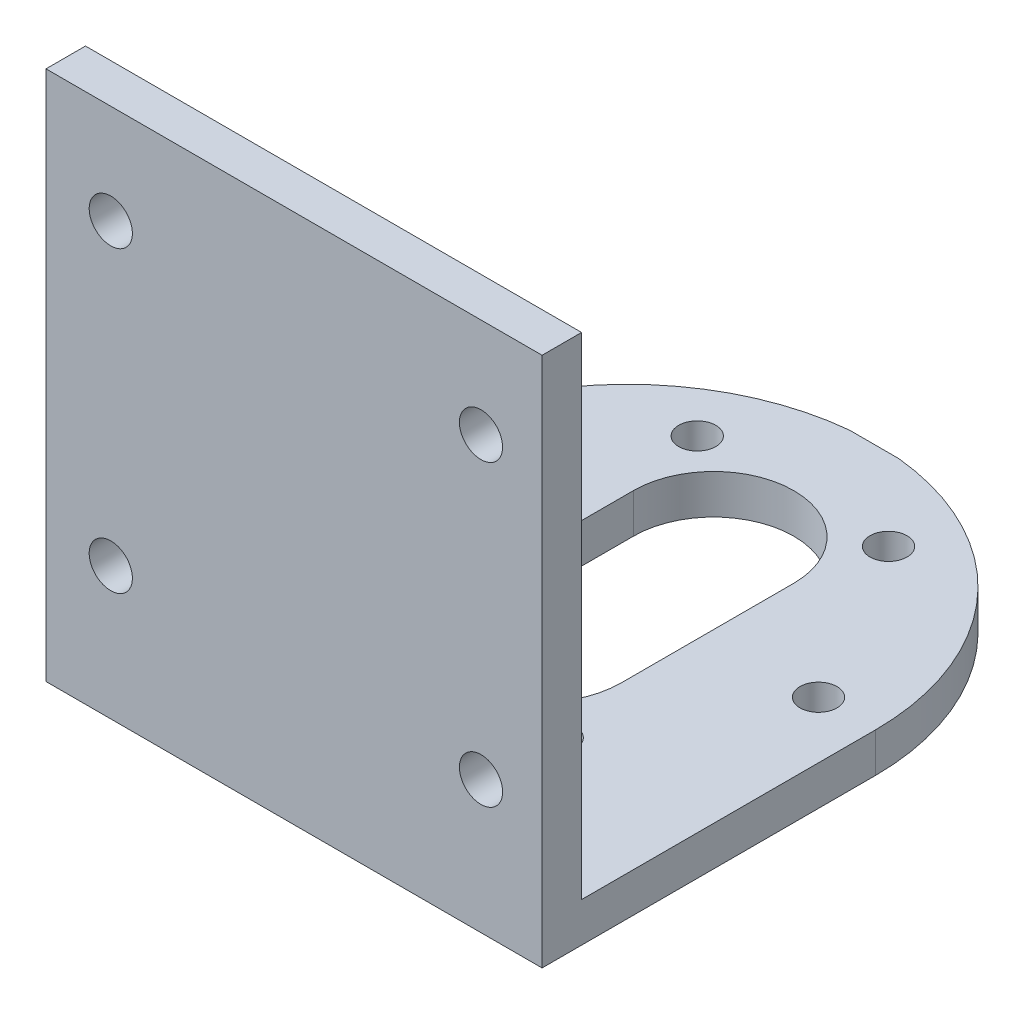
ISO-10303-21;
HEADER;
FILE_DESCRIPTION(('STEP AP214'),'2;1');
FILE_NAME('part.step','',(''),(''),'','','');
FILE_SCHEMA(('AUTOMOTIVE_DESIGN { 1 0 10303 214 1 1 1 1 }'));
ENDSEC;
DATA;
#1=APPLICATION_CONTEXT('core data for automotive mechanical design processes');
#2=APPLICATION_PROTOCOL_DEFINITION('international standard','automotive_design',2000,#1);
#3=PRODUCT_CONTEXT('',#1,'mechanical');
#4=PRODUCT('Part','Part','',(#3));
#5=PRODUCT_RELATED_PRODUCT_CATEGORY('part','',(#4));
#6=PRODUCT_DEFINITION_FORMATION('','',#4);
#7=PRODUCT_DEFINITION_CONTEXT('part definition',#1,'design');
#8=PRODUCT_DEFINITION('design','',#6,#7);
#9=PRODUCT_DEFINITION_SHAPE('','',#8);
#10=(LENGTH_UNIT() NAMED_UNIT(*) SI_UNIT(.MILLI.,.METRE.));
#11=(NAMED_UNIT(*) PLANE_ANGLE_UNIT() SI_UNIT($,.RADIAN.));
#12=(NAMED_UNIT(*) SI_UNIT($,.STERADIAN.) SOLID_ANGLE_UNIT());
#13=UNCERTAINTY_MEASURE_WITH_UNIT(LENGTH_MEASURE(1.E-05),#10,'distance_accuracy_value','');
#14=(GEOMETRIC_REPRESENTATION_CONTEXT(3) GLOBAL_UNCERTAINTY_ASSIGNED_CONTEXT((#13)) GLOBAL_UNIT_ASSIGNED_CONTEXT((#10,
#11,#12)) REPRESENTATION_CONTEXT('',''));
#15=CARTESIAN_POINT('',(0.,0.,0.));
#16=DIRECTION('',(0.,0.,1.));
#17=DIRECTION('',(1.,0.,0.));
#18=AXIS2_PLACEMENT_3D('',#15,#16,#17);
#19=CARTESIAN_POINT('',(0.,0.,3.2));
#20=DIRECTION('',(0.,1.,0.));
#21=DIRECTION('',(0.,0.,1.));
#22=AXIS2_PLACEMENT_3D('',#19,#20,#21);
#23=PLANE('',#22);
#24=CARTESIAN_POINT('',(4.6,0.,-23.8));
#25=DIRECTION('',(0.,-1.,0.));
#26=DIRECTION('',(0.,0.,-1.));
#27=AXIS2_PLACEMENT_3D('',#24,#25,#26);
#28=CIRCLE('',#27,3.02854263248526);
#29=CARTESIAN_POINT('',(4.6,0.,-26.8285426324853));
#30=VERTEX_POINT('',#29);
#31=EDGE_CURVE('E398',#30,#30,#28,.T.);
#32=ORIENTED_EDGE('',*,*,#31,.F.);
#33=EDGE_LOOP('',(#32));
#34=FACE_BOUND('',#33,.T.);
#35=CARTESIAN_POINT('',(27.8500000000001,0.,-10.3766062413412));
#36=DIRECTION('',(0.,-1.,0.));
#37=DIRECTION('',(0.,0.,-1.));
#38=AXIS2_PLACEMENT_3D('',#35,#36,#37);
#39=CIRCLE('',#38,3.02854263248526);
#40=CARTESIAN_POINT('',(27.8500000000001,0.,-13.4051488738265));
#41=VERTEX_POINT('',#40);
#42=EDGE_CURVE('E388',#41,#41,#39,.T.);
#43=ORIENTED_EDGE('',*,*,#42,.F.);
#44=EDGE_LOOP('',(#43));
#45=FACE_BOUND('',#44,.T.);
#46=CARTESIAN_POINT('',(35.6,0.,-23.8000000000001));
#47=DIRECTION('',(0.,-1.,0.));
#48=DIRECTION('',(0.,0.,-1.));
#49=AXIS2_PLACEMENT_3D('',#46,#47,#48);
#50=CIRCLE('',#49,3.02854263248526);
#51=CARTESIAN_POINT('',(35.6,0.,-26.8285426324854));
#52=VERTEX_POINT('',#51);
#53=EDGE_CURVE('E418',#52,#52,#50,.T.);
#54=ORIENTED_EDGE('',*,*,#53,.F.);
#55=EDGE_LOOP('',(#54));
#56=FACE_BOUND('',#55,.T.);
#57=CARTESIAN_POINT('',(12.3499999999998,0.,-37.2233937586587));
#58=DIRECTION('',(0.,-1.,0.));
#59=DIRECTION('',(0.,0.,-1.));
#60=AXIS2_PLACEMENT_3D('',#57,#58,#59);
#61=CIRCLE('',#60,3.02854263248526);
#62=CARTESIAN_POINT('',(12.3499999999998,0.,-40.251936391144));
#63=VERTEX_POINT('',#62);
#64=EDGE_CURVE('E408',#63,#63,#61,.T.);
#65=ORIENTED_EDGE('',*,*,#64,.F.);
#66=EDGE_LOOP('',(#65));
#67=FACE_BOUND('',#66,.T.);
#68=CARTESIAN_POINT('',(12.35,0.,-10.3766062413412));
#69=DIRECTION('',(0.,-1.,0.));
#70=DIRECTION('',(0.,0.,-1.));
#71=AXIS2_PLACEMENT_3D('',#68,#69,#70);
#72=CIRCLE('',#71,3.02854263248526);
#73=CARTESIAN_POINT('',(12.35,0.,-13.4051488738264));
#74=VERTEX_POINT('',#73);
#75=EDGE_CURVE('E380',#74,#74,#72,.T.);
#76=ORIENTED_EDGE('',*,*,#75,.F.);
#77=EDGE_LOOP('',(#76));
#78=FACE_BOUND('',#77,.T.);
#79=CARTESIAN_POINT('',(27.8499999999999,0.,-37.2233937586589));
#80=DIRECTION('',(0.,-1.,0.));
#81=DIRECTION('',(0.,0.,-1.));
#82=AXIS2_PLACEMENT_3D('',#79,#80,#81);
#83=CIRCLE('',#82,3.02854263248526);
#84=CARTESIAN_POINT('',(27.8499999999999,0.,-40.2519363911441));
#85=VERTEX_POINT('',#84);
#86=EDGE_CURVE('E412',#85,#85,#83,.T.);
#87=ORIENTED_EDGE('',*,*,#86,.F.);
#88=EDGE_LOOP('',(#87));
#89=FACE_BOUND('',#88,.T.);
#90=DIRECTION('',(0.,0.,1.));
#91=VECTOR('',#90,1.);
#92=CARTESIAN_POINT('',(13.6,0.,0.));
#93=LINE('',#92,#91);
#94=CARTESIAN_POINT('',(13.6,0.,-30.8));
#95=VERTEX_POINT('',#94);
#96=CARTESIAN_POINT('',(13.6,0.,-16.8));
#97=VERTEX_POINT('',#96);
#98=EDGE_CURVE('E269',#95,#97,#93,.T.);
#99=ORIENTED_EDGE('',*,*,#98,.T.);
#100=CARTESIAN_POINT('',(20.1,0.,-16.8));
#101=DIRECTION('',(0.,-1.,0.));
#102=DIRECTION('',(0.,0.,-1.));
#103=AXIS2_PLACEMENT_3D('',#100,#101,#102);
#104=CIRCLE('',#103,6.5);
#105=CARTESIAN_POINT('',(26.6,0.,-16.8));
#106=VERTEX_POINT('',#105);
#107=EDGE_CURVE('E453',#106,#97,#104,.T.);
#108=ORIENTED_EDGE('',*,*,#107,.F.);
#109=DIRECTION('',(0.,0.,-1.));
#110=VECTOR('',#109,1.);
#111=CARTESIAN_POINT('',(26.6,0.,0.));
#112=LINE('',#111,#110);
#113=CARTESIAN_POINT('',(26.6,0.,-30.8));
#114=VERTEX_POINT('',#113);
#115=EDGE_CURVE('E449',#106,#114,#112,.T.);
#116=ORIENTED_EDGE('',*,*,#115,.T.);
#117=CARTESIAN_POINT('',(20.1,0.,-30.8));
#118=DIRECTION('',(0.,-1.,0.));
#119=DIRECTION('',(0.,0.,-1.));
#120=AXIS2_PLACEMENT_3D('',#117,#118,#119);
#121=CIRCLE('',#120,6.5);
#122=EDGE_CURVE('E445',#95,#114,#121,.T.);
#123=ORIENTED_EDGE('',*,*,#122,.F.);
#124=EDGE_LOOP('',(#99,#108,#116,#123));
#125=FACE_BOUND('',#124,.T.);
#126=CARTESIAN_POINT('',(20.1,0.,-23.8));
#127=DIRECTION('',(0.,-1.,0.));
#128=DIRECTION('',(0.,0.,-1.));
#129=AXIS2_PLACEMENT_3D('',#126,#127,#128);
#130=CIRCLE('',#129,20.1);
#131=CARTESIAN_POINT('',(0.,0.,-23.8));
#132=VERTEX_POINT('',#131);
#133=CARTESIAN_POINT('',(18.0975015605499,0.,-43.8));
#134=VERTEX_POINT('',#133);
#135=EDGE_CURVE('E185',#132,#134,#130,.T.);
#136=ORIENTED_EDGE('',*,*,#135,.T.);
#137=DIRECTION('',(-1.,0.,0.));
#138=VECTOR('',#137,1.);
#139=CARTESIAN_POINT('',(40.2,0.,-43.8));
#140=LINE('',#139,#138);
#141=CARTESIAN_POINT('',(22.1024984394501,0.,-43.8));
#142=VERTEX_POINT('',#141);
#143=EDGE_CURVE('E287',#142,#134,#140,.T.);
#144=ORIENTED_EDGE('',*,*,#143,.F.);
#145=CARTESIAN_POINT('',(20.1,0.,-23.8));
#146=DIRECTION('',(0.,-1.,0.));
#147=DIRECTION('',(0.,0.,-1.));
#148=AXIS2_PLACEMENT_3D('',#145,#146,#147);
#149=CIRCLE('',#148,20.1);
#150=CARTESIAN_POINT('',(40.2,0.,-23.8));
#151=VERTEX_POINT('',#150);
#152=EDGE_CURVE('E121',#142,#151,#149,.T.);
#153=ORIENTED_EDGE('',*,*,#152,.T.);
#154=DIRECTION('',(0.,0.,-1.));
#155=VECTOR('',#154,1.);
#156=CARTESIAN_POINT('',(40.2,0.,3.2));
#157=LINE('',#156,#155);
#158=CARTESIAN_POINT('',(40.2,0.,3.2));
#159=VERTEX_POINT('',#158);
#160=EDGE_CURVE('E213',#159,#151,#157,.T.);
#161=ORIENTED_EDGE('',*,*,#160,.F.);
#162=DIRECTION('',(1.,0.,0.));
#163=VECTOR('',#162,1.);
#164=CARTESIAN_POINT('',(0.,0.,3.2));
#165=LINE('',#164,#163);
#166=CARTESIAN_POINT('',(0.,0.,3.2));
#167=VERTEX_POINT('',#166);
#168=EDGE_CURVE('E209',#167,#159,#165,.T.);
#169=ORIENTED_EDGE('',*,*,#168,.F.);
#170=DIRECTION('',(0.,0.,-1.));
#171=VECTOR('',#170,1.);
#172=CARTESIAN_POINT('',(0.,0.,3.2));
#173=LINE('',#172,#171);
#174=EDGE_CURVE('E200',#167,#132,#173,.T.);
#175=ORIENTED_EDGE('',*,*,#174,.T.);
#176=EDGE_LOOP('',(#136,#144,#153,#161,#169,#175));
#177=FACE_BOUND('',#176,.T.);
#178=ADVANCED_FACE('F98',(#34,#45,#56,#67,#78,#89,#125,#177),#23,.F.);
#179=CARTESIAN_POINT('',(40.2,3.2,-43.8));
#180=DIRECTION('',(0.,-1.,0.));
#181=DIRECTION('',(0.,0.,-1.));
#182=AXIS2_PLACEMENT_3D('',#179,#180,#181);
#183=PLANE('',#182);
#184=CARTESIAN_POINT('',(27.8499999999999,3.2,-37.2233937586589));
#185=DIRECTION('',(0.,-1.,0.));
#186=DIRECTION('',(0.,0.,-1.));
#187=AXIS2_PLACEMENT_3D('',#184,#185,#186);
#188=CIRCLE('',#187,1.5);
#189=CARTESIAN_POINT('',(27.8499999999999,3.2,-38.7233937586589));
#190=VERTEX_POINT('',#189);
#191=EDGE_CURVE('E256',#190,#190,#188,.T.);
#192=ORIENTED_EDGE('',*,*,#191,.T.);
#193=EDGE_LOOP('',(#192));
#194=FACE_BOUND('',#193,.T.);
#195=CARTESIAN_POINT('',(35.6,3.2,-23.8000000000001));
#196=DIRECTION('',(0.,-1.,0.));
#197=DIRECTION('',(0.,0.,-1.));
#198=AXIS2_PLACEMENT_3D('',#195,#196,#197);
#199=CIRCLE('',#198,1.5);
#200=CARTESIAN_POINT('',(35.6,3.2,-25.3000000000001));
#201=VERTEX_POINT('',#200);
#202=EDGE_CURVE('E252',#201,#201,#199,.T.);
#203=ORIENTED_EDGE('',*,*,#202,.T.);
#204=EDGE_LOOP('',(#203));
#205=FACE_BOUND('',#204,.T.);
#206=CARTESIAN_POINT('',(12.35,3.2,-10.3766062413412));
#207=DIRECTION('',(0.,-1.,0.));
#208=DIRECTION('',(0.,0.,-1.));
#209=AXIS2_PLACEMENT_3D('',#206,#207,#208);
#210=CIRCLE('',#209,1.5);
#211=CARTESIAN_POINT('',(12.35,3.2,-11.8766062413412));
#212=VERTEX_POINT('',#211);
#213=EDGE_CURVE('E248',#212,#212,#210,.T.);
#214=ORIENTED_EDGE('',*,*,#213,.T.);
#215=EDGE_LOOP('',(#214));
#216=FACE_BOUND('',#215,.T.);
#217=CARTESIAN_POINT('',(12.3499999999998,3.2,-37.2233937586587));
#218=DIRECTION('',(0.,-1.,0.));
#219=DIRECTION('',(0.,0.,-1.));
#220=AXIS2_PLACEMENT_3D('',#217,#218,#219);
#221=CIRCLE('',#220,1.5);
#222=CARTESIAN_POINT('',(12.3499999999998,3.2,-38.7233937586587));
#223=VERTEX_POINT('',#222);
#224=EDGE_CURVE('E244',#223,#223,#221,.T.);
#225=ORIENTED_EDGE('',*,*,#224,.T.);
#226=EDGE_LOOP('',(#225));
#227=FACE_BOUND('',#226,.T.);
#228=CARTESIAN_POINT('',(4.6,3.2,-23.8));
#229=DIRECTION('',(0.,-1.,0.));
#230=DIRECTION('',(0.,0.,-1.));
#231=AXIS2_PLACEMENT_3D('',#228,#229,#230);
#232=CIRCLE('',#231,1.5);
#233=CARTESIAN_POINT('',(4.6,3.2,-25.3));
#234=VERTEX_POINT('',#233);
#235=EDGE_CURVE('E239',#234,#234,#232,.T.);
#236=ORIENTED_EDGE('',*,*,#235,.T.);
#237=EDGE_LOOP('',(#236));
#238=FACE_BOUND('',#237,.T.);
#239=CARTESIAN_POINT('',(27.8500000000001,3.2,-10.3766062413412));
#240=DIRECTION('',(0.,-1.,0.));
#241=DIRECTION('',(0.,0.,-1.));
#242=AXIS2_PLACEMENT_3D('',#239,#240,#241);
#243=CIRCLE('',#242,1.5);
#244=CARTESIAN_POINT('',(27.8500000000001,3.2,-11.8766062413412));
#245=VERTEX_POINT('',#244);
#246=EDGE_CURVE('E235',#245,#245,#243,.T.);
#247=ORIENTED_EDGE('',*,*,#246,.T.);
#248=EDGE_LOOP('',(#247));
#249=FACE_BOUND('',#248,.T.);
#250=DIRECTION('',(0.,0.,1.));
#251=VECTOR('',#250,1.);
#252=CARTESIAN_POINT('',(13.6,3.2,-43.8));
#253=LINE('',#252,#251);
#254=CARTESIAN_POINT('',(13.6,3.2,-30.8));
#255=VERTEX_POINT('',#254);
#256=CARTESIAN_POINT('',(13.6,3.2,-16.8));
#257=VERTEX_POINT('',#256);
#258=EDGE_CURVE('E232',#255,#257,#253,.T.);
#259=ORIENTED_EDGE('',*,*,#258,.F.);
#260=CARTESIAN_POINT('',(20.1,3.2,-30.8));
#261=DIRECTION('',(0.,-1.,0.));
#262=DIRECTION('',(0.,0.,-1.));
#263=AXIS2_PLACEMENT_3D('',#260,#261,#262);
#264=CIRCLE('',#263,6.5);
#265=CARTESIAN_POINT('',(26.6,3.2,-30.8));
#266=VERTEX_POINT('',#265);
#267=EDGE_CURVE('E212',#255,#266,#264,.T.);
#268=ORIENTED_EDGE('',*,*,#267,.T.);
#269=DIRECTION('',(0.,0.,-1.));
#270=VECTOR('',#269,1.);
#271=CARTESIAN_POINT('',(26.6,3.2,-43.8));
#272=LINE('',#271,#270);
#273=CARTESIAN_POINT('',(26.6,3.2,-16.8));
#274=VERTEX_POINT('',#273);
#275=EDGE_CURVE('E218',#274,#266,#272,.T.);
#276=ORIENTED_EDGE('',*,*,#275,.F.);
#277=CARTESIAN_POINT('',(20.1,3.2,-16.8));
#278=DIRECTION('',(0.,-1.,0.));
#279=DIRECTION('',(0.,0.,-1.));
#280=AXIS2_PLACEMENT_3D('',#277,#278,#279);
#281=CIRCLE('',#280,6.5);
#282=EDGE_CURVE('E228',#274,#257,#281,.T.);
#283=ORIENTED_EDGE('',*,*,#282,.T.);
#284=EDGE_LOOP('',(#259,#268,#276,#283));
#285=FACE_BOUND('',#284,.T.);
#286=CARTESIAN_POINT('',(20.1,3.2,-23.8));
#287=DIRECTION('',(0.,-1.,0.));
#288=DIRECTION('',(0.,0.,-1.));
#289=AXIS2_PLACEMENT_3D('',#286,#287,#288);
#290=CIRCLE('',#289,20.1);
#291=CARTESIAN_POINT('',(0.,3.2,-23.8));
#292=VERTEX_POINT('',#291);
#293=CARTESIAN_POINT('',(18.0975015605499,3.2,-43.8));
#294=VERTEX_POINT('',#293);
#295=EDGE_CURVE('E113',#292,#294,#290,.T.);
#296=ORIENTED_EDGE('',*,*,#295,.F.);
#297=DIRECTION('',(0.,0.,1.));
#298=VECTOR('',#297,1.);
#299=CARTESIAN_POINT('',(0.,3.2,-43.8));
#300=LINE('',#299,#298);
#301=CARTESIAN_POINT('',(0.,3.2,0.));
#302=VERTEX_POINT('',#301);
#303=EDGE_CURVE('E203',#292,#302,#300,.T.);
#304=ORIENTED_EDGE('',*,*,#303,.T.);
#305=DIRECTION('',(1.,0.,0.));
#306=VECTOR('',#305,1.);
#307=CARTESIAN_POINT('',(40.2,3.2,0.));
#308=LINE('',#307,#306);
#309=CARTESIAN_POINT('',(40.2,3.2,0.));
#310=VERTEX_POINT('',#309);
#311=EDGE_CURVE('E260',#302,#310,#308,.T.);
#312=ORIENTED_EDGE('',*,*,#311,.T.);
#313=DIRECTION('',(0.,0.,1.));
#314=VECTOR('',#313,1.);
#315=CARTESIAN_POINT('',(40.2,3.2,-43.8));
#316=LINE('',#315,#314);
#317=CARTESIAN_POINT('',(40.2,3.2,-23.8));
#318=VERTEX_POINT('',#317);
#319=EDGE_CURVE('E282',#318,#310,#316,.T.);
#320=ORIENTED_EDGE('',*,*,#319,.F.);
#321=CARTESIAN_POINT('',(20.1,3.2,-23.8));
#322=DIRECTION('',(0.,-1.,0.));
#323=DIRECTION('',(0.,0.,-1.));
#324=AXIS2_PLACEMENT_3D('',#321,#322,#323);
#325=CIRCLE('',#324,20.1);
#326=CARTESIAN_POINT('',(22.1024984394501,3.2,-43.8));
#327=VERTEX_POINT('',#326);
#328=EDGE_CURVE('E205',#327,#318,#325,.T.);
#329=ORIENTED_EDGE('',*,*,#328,.F.);
#330=DIRECTION('',(1.,0.,0.));
#331=VECTOR('',#330,1.);
#332=CARTESIAN_POINT('',(40.2,3.2,-43.8));
#333=LINE('',#332,#331);
#334=EDGE_CURVE('E280',#294,#327,#333,.T.);
#335=ORIENTED_EDGE('',*,*,#334,.F.);
#336=EDGE_LOOP('',(#296,#304,#312,#320,#329,#335));
#337=FACE_BOUND('',#336,.T.);
#338=ADVANCED_FACE('F279',(#194,#205,#216,#227,#238,#249,#285,#337),#183,.F.);
#339=CARTESIAN_POINT('',(0.,0.,3.2));
#340=DIRECTION('',(-1.,0.,0.));
#341=DIRECTION('',(0.,0.,1.));
#342=AXIS2_PLACEMENT_3D('',#339,#340,#341);
#343=PLANE('',#342);
#344=ORIENTED_EDGE('',*,*,#303,.F.);
#345=DIRECTION('',(0.,-1.,0.));
#346=VECTOR('',#345,1.);
#347=CARTESIAN_POINT('',(0.,43.,-23.8));
#348=LINE('',#347,#346);
#349=EDGE_CURVE('E188',#292,#132,#348,.T.);
#350=ORIENTED_EDGE('',*,*,#349,.T.);
#351=ORIENTED_EDGE('',*,*,#174,.F.);
#352=DIRECTION('',(0.,1.,0.));
#353=VECTOR('',#352,1.);
#354=CARTESIAN_POINT('',(0.,0.,3.2));
#355=LINE('',#354,#353);
#356=CARTESIAN_POINT('',(0.,43.,3.2));
#357=VERTEX_POINT('',#356);
#358=EDGE_CURVE('E313',#167,#357,#355,.T.);
#359=ORIENTED_EDGE('',*,*,#358,.T.);
#360=DIRECTION('',(0.,0.,-1.));
#361=VECTOR('',#360,1.);
#362=CARTESIAN_POINT('',(0.,43.,3.2));
#363=LINE('',#362,#361);
#364=CARTESIAN_POINT('',(0.,43.,0.));
#365=VERTEX_POINT('',#364);
#366=EDGE_CURVE('E329',#357,#365,#363,.T.);
#367=ORIENTED_EDGE('',*,*,#366,.T.);
#368=DIRECTION('',(0.,1.,0.));
#369=VECTOR('',#368,1.);
#370=CARTESIAN_POINT('',(0.,0.,0.));
#371=LINE('',#370,#369);
#372=EDGE_CURVE('E341',#302,#365,#371,.T.);
#373=ORIENTED_EDGE('',*,*,#372,.F.);
#374=EDGE_LOOP('',(#344,#350,#351,#359,#367,#373));
#375=FACE_BOUND('',#374,.T.);
#376=ADVANCED_FACE('F198',(#375),#343,.T.);
#377=CARTESIAN_POINT('',(40.2,0.,3.2));
#378=DIRECTION('',(-1.,0.,0.));
#379=DIRECTION('',(0.,0.,1.));
#380=AXIS2_PLACEMENT_3D('',#377,#378,#379);
#381=PLANE('',#380);
#382=DIRECTION('',(0.,-1.,0.));
#383=VECTOR('',#382,1.);
#384=CARTESIAN_POINT('',(40.2,43.,-23.8));
#385=LINE('',#384,#383);
#386=EDGE_CURVE('E194',#318,#151,#385,.T.);
#387=ORIENTED_EDGE('',*,*,#386,.F.);
#388=ORIENTED_EDGE('',*,*,#319,.T.);
#389=DIRECTION('',(0.,1.,0.));
#390=VECTOR('',#389,1.);
#391=CARTESIAN_POINT('',(40.2,0.,0.));
#392=LINE('',#391,#390);
#393=CARTESIAN_POINT('',(40.2,43.,0.));
#394=VERTEX_POINT('',#393);
#395=EDGE_CURVE('E344',#310,#394,#392,.T.);
#396=ORIENTED_EDGE('',*,*,#395,.T.);
#397=DIRECTION('',(0.,0.,-1.));
#398=VECTOR('',#397,1.);
#399=CARTESIAN_POINT('',(40.2,43.,3.2));
#400=LINE('',#399,#398);
#401=CARTESIAN_POINT('',(40.2,43.,3.2));
#402=VERTEX_POINT('',#401);
#403=EDGE_CURVE('E221',#402,#394,#400,.T.);
#404=ORIENTED_EDGE('',*,*,#403,.F.);
#405=DIRECTION('',(0.,1.,0.));
#406=VECTOR('',#405,1.);
#407=CARTESIAN_POINT('',(40.2,0.,3.2));
#408=LINE('',#407,#406);
#409=EDGE_CURVE('E318',#159,#402,#408,.T.);
#410=ORIENTED_EDGE('',*,*,#409,.F.);
#411=ORIENTED_EDGE('',*,*,#160,.T.);
#412=EDGE_LOOP('',(#387,#388,#396,#404,#410,#411));
#413=FACE_BOUND('',#412,.T.);
#414=ADVANCED_FACE('F371',(#413),#381,.F.);
#415=CARTESIAN_POINT('',(0.,0.,-43.8));
#416=DIRECTION('',(0.,0.,1.));
#417=DIRECTION('',(1.,0.,0.));
#418=AXIS2_PLACEMENT_3D('',#415,#416,#417);
#419=PLANE('',#418);
#420=DIRECTION('',(0.,-1.,0.));
#421=VECTOR('',#420,1.);
#422=CARTESIAN_POINT('',(18.0975015605499,43.,-43.8));
#423=LINE('',#422,#421);
#424=EDGE_CURVE('E12',#294,#134,#423,.T.);
#425=ORIENTED_EDGE('',*,*,#424,.F.);
#426=ORIENTED_EDGE('',*,*,#334,.T.);
#427=DIRECTION('',(0.,-1.,0.));
#428=VECTOR('',#427,1.);
#429=CARTESIAN_POINT('',(22.1024984394501,43.,-43.8));
#430=LINE('',#429,#428);
#431=EDGE_CURVE('E107',#142,#327,#430,.F.);
#432=ORIENTED_EDGE('',*,*,#431,.F.);
#433=ORIENTED_EDGE('',*,*,#143,.T.);
#434=EDGE_LOOP('',(#425,#426,#432,#433));
#435=FACE_BOUND('',#434,.T.);
#436=ADVANCED_FACE('F285',(#435),#419,.F.);
#437=CARTESIAN_POINT('',(27.8500000000001,43.,-10.3766062413412));
#438=DIRECTION('',(0.,-1.,0.));
#439=DIRECTION('',(0.,0.,-1.));
#440=AXIS2_PLACEMENT_3D('',#437,#438,#439);
#441=CYLINDRICAL_SURFACE('',#440,1.5);
#442=ORIENTED_EDGE('',*,*,#246,.F.);
#443=EDGE_LOOP('',(#442));
#444=FACE_BOUND('',#443,.T.);
#445=CARTESIAN_POINT('',(27.8500000000001,1.,-10.3766062413412));
#446=DIRECTION('',(0.,-1.,0.));
#447=DIRECTION('',(0.,0.,-1.));
#448=AXIS2_PLACEMENT_3D('',#445,#446,#447);
#449=CIRCLE('',#448,1.5);
#450=CARTESIAN_POINT('',(27.8500000000001,1.,-11.8766062413412));
#451=VERTEX_POINT('',#450);
#452=EDGE_CURVE('E393',#451,#451,#449,.F.);
#453=ORIENTED_EDGE('',*,*,#452,.F.);
#454=EDGE_LOOP('',(#453));
#455=FACE_BOUND('',#454,.T.);
#456=ADVANCED_FACE('F590',(#444,#455),#441,.F.);
#457=CARTESIAN_POINT('',(4.6,43.,-23.8));
#458=DIRECTION('',(0.,-1.,0.));
#459=DIRECTION('',(0.,0.,-1.));
#460=AXIS2_PLACEMENT_3D('',#457,#458,#459);
#461=CYLINDRICAL_SURFACE('',#460,1.5);
#462=ORIENTED_EDGE('',*,*,#235,.F.);
#463=EDGE_LOOP('',(#462));
#464=FACE_BOUND('',#463,.T.);
#465=CARTESIAN_POINT('',(4.6,1.,-23.8));
#466=DIRECTION('',(0.,-1.,0.));
#467=DIRECTION('',(0.,0.,-1.));
#468=AXIS2_PLACEMENT_3D('',#465,#466,#467);
#469=CIRCLE('',#468,1.5);
#470=CARTESIAN_POINT('',(4.6,1.,-25.3));
#471=VERTEX_POINT('',#470);
#472=EDGE_CURVE('E265',#471,#471,#469,.F.);
#473=ORIENTED_EDGE('',*,*,#472,.F.);
#474=EDGE_LOOP('',(#473));
#475=FACE_BOUND('',#474,.T.);
#476=ADVANCED_FACE('F595',(#464,#475),#461,.F.);
#477=CARTESIAN_POINT('',(12.3499999999998,43.,-37.2233937586587));
#478=DIRECTION('',(0.,-1.,0.));
#479=DIRECTION('',(0.,0.,-1.));
#480=AXIS2_PLACEMENT_3D('',#477,#478,#479);
#481=CYLINDRICAL_SURFACE('',#480,1.5);
#482=ORIENTED_EDGE('',*,*,#224,.F.);
#483=EDGE_LOOP('',(#482));
#484=FACE_BOUND('',#483,.T.);
#485=CARTESIAN_POINT('',(12.3499999999998,1.,-37.2233937586587));
#486=DIRECTION('',(0.,-1.,0.));
#487=DIRECTION('',(0.,0.,-1.));
#488=AXIS2_PLACEMENT_3D('',#485,#486,#487);
#489=CIRCLE('',#488,1.5);
#490=CARTESIAN_POINT('',(12.3499999999998,1.,-38.7233937586587));
#491=VERTEX_POINT('',#490);
#492=EDGE_CURVE('E413',#491,#491,#489,.F.);
#493=ORIENTED_EDGE('',*,*,#492,.F.);
#494=EDGE_LOOP('',(#493));
#495=FACE_BOUND('',#494,.T.);
#496=ADVANCED_FACE('F607',(#484,#495),#481,.F.);
#497=CARTESIAN_POINT('',(12.35,43.,-10.3766062413412));
#498=DIRECTION('',(0.,-1.,0.));
#499=DIRECTION('',(0.,0.,-1.));
#500=AXIS2_PLACEMENT_3D('',#497,#498,#499);
#501=CYLINDRICAL_SURFACE('',#500,1.5);
#502=ORIENTED_EDGE('',*,*,#213,.F.);
#503=EDGE_LOOP('',(#502));
#504=FACE_BOUND('',#503,.T.);
#505=CARTESIAN_POINT('',(12.35,1.,-10.3766062413412));
#506=DIRECTION('',(0.,-1.,0.));
#507=DIRECTION('',(0.,0.,-1.));
#508=AXIS2_PLACEMENT_3D('',#505,#506,#507);
#509=CIRCLE('',#508,1.5);
#510=CARTESIAN_POINT('',(12.35,1.,-11.8766062413412));
#511=VERTEX_POINT('',#510);
#512=EDGE_CURVE('E261',#511,#511,#509,.F.);
#513=ORIENTED_EDGE('',*,*,#512,.F.);
#514=EDGE_LOOP('',(#513));
#515=FACE_BOUND('',#514,.T.);
#516=ADVANCED_FACE('F617',(#504,#515),#501,.F.);
#517=CARTESIAN_POINT('',(35.6,43.,-23.8000000000001));
#518=DIRECTION('',(0.,-1.,0.));
#519=DIRECTION('',(0.,0.,-1.));
#520=AXIS2_PLACEMENT_3D('',#517,#518,#519);
#521=CYLINDRICAL_SURFACE('',#520,1.5);
#522=ORIENTED_EDGE('',*,*,#202,.F.);
#523=EDGE_LOOP('',(#522));
#524=FACE_BOUND('',#523,.T.);
#525=CARTESIAN_POINT('',(35.6,1.,-23.8000000000001));
#526=DIRECTION('',(0.,-1.,0.));
#527=DIRECTION('',(0.,0.,-1.));
#528=AXIS2_PLACEMENT_3D('',#525,#526,#527);
#529=CIRCLE('',#528,1.5);
#530=CARTESIAN_POINT('',(35.6,1.,-25.3000000000001));
#531=VERTEX_POINT('',#530);
#532=EDGE_CURVE('E425',#531,#531,#529,.F.);
#533=ORIENTED_EDGE('',*,*,#532,.F.);
#534=EDGE_LOOP('',(#533));
#535=FACE_BOUND('',#534,.T.);
#536=ADVANCED_FACE('F535',(#524,#535),#521,.F.);
#537=CARTESIAN_POINT('',(27.8499999999999,43.,-37.2233937586589));
#538=DIRECTION('',(0.,-1.,0.));
#539=DIRECTION('',(0.,0.,-1.));
#540=AXIS2_PLACEMENT_3D('',#537,#538,#539);
#541=CYLINDRICAL_SURFACE('',#540,1.5);
#542=ORIENTED_EDGE('',*,*,#191,.F.);
#543=EDGE_LOOP('',(#542));
#544=FACE_BOUND('',#543,.T.);
#545=CARTESIAN_POINT('',(27.8499999999999,1.,-37.2233937586589));
#546=DIRECTION('',(0.,-1.,0.));
#547=DIRECTION('',(0.,0.,-1.));
#548=AXIS2_PLACEMENT_3D('',#545,#546,#547);
#549=CIRCLE('',#548,1.5);
#550=CARTESIAN_POINT('',(27.8499999999999,1.,-38.7233937586589));
#551=VERTEX_POINT('',#550);
#552=EDGE_CURVE('E432',#551,#551,#549,.F.);
#553=ORIENTED_EDGE('',*,*,#552,.F.);
#554=EDGE_LOOP('',(#553));
#555=FACE_BOUND('',#554,.T.);
#556=ADVANCED_FACE('F526',(#544,#555),#541,.F.);
#557=CARTESIAN_POINT('',(0.,0.,0.));
#558=DIRECTION('',(0.,0.,1.));
#559=DIRECTION('',(1.,0.,0.));
#560=AXIS2_PLACEMENT_3D('',#557,#558,#559);
#561=PLANE('',#560);
#562=CARTESIAN_POINT('',(35.25,34.95,0.));
#563=DIRECTION('',(0.,0.,1.));
#564=DIRECTION('',(1.,0.,0.));
#565=AXIS2_PLACEMENT_3D('',#562,#563,#564);
#566=CIRCLE('',#565,1.75);
#567=CARTESIAN_POINT('',(37.,34.95,0.));
#568=VERTEX_POINT('',#567);
#569=EDGE_CURVE('E305',#568,#568,#566,.F.);
#570=ORIENTED_EDGE('',*,*,#569,.F.);
#571=EDGE_LOOP('',(#570));
#572=FACE_BOUND('',#571,.T.);
#573=CARTESIAN_POINT('',(5.25,34.95,0.));
#574=DIRECTION('',(0.,0.,1.));
#575=DIRECTION('',(1.,0.,0.));
#576=AXIS2_PLACEMENT_3D('',#573,#574,#575);
#577=CIRCLE('',#576,1.75);
#578=CARTESIAN_POINT('',(7.,34.95,0.));
#579=VERTEX_POINT('',#578);
#580=EDGE_CURVE('E337',#579,#579,#577,.T.);
#581=ORIENTED_EDGE('',*,*,#580,.T.);
#582=EDGE_LOOP('',(#581));
#583=FACE_BOUND('',#582,.T.);
#584=CARTESIAN_POINT('',(5.25,10.75,0.));
#585=DIRECTION('',(0.,0.,1.));
#586=DIRECTION('',(1.,0.,0.));
#587=AXIS2_PLACEMENT_3D('',#584,#585,#586);
#588=CIRCLE('',#587,1.75);
#589=CARTESIAN_POINT('',(7.,10.75,0.));
#590=VERTEX_POINT('',#589);
#591=EDGE_CURVE('E333',#590,#590,#588,.T.);
#592=ORIENTED_EDGE('',*,*,#591,.T.);
#593=EDGE_LOOP('',(#592));
#594=FACE_BOUND('',#593,.T.);
#595=CARTESIAN_POINT('',(35.25,10.75,0.));
#596=DIRECTION('',(0.,0.,1.));
#597=DIRECTION('',(1.,0.,0.));
#598=AXIS2_PLACEMENT_3D('',#595,#596,#597);
#599=CIRCLE('',#598,1.75);
#600=CARTESIAN_POINT('',(37.,10.75,0.));
#601=VERTEX_POINT('',#600);
#602=EDGE_CURVE('E299',#601,#601,#599,.F.);
#603=ORIENTED_EDGE('',*,*,#602,.F.);
#604=EDGE_LOOP('',(#603));
#605=FACE_BOUND('',#604,.T.);
#606=ORIENTED_EDGE('',*,*,#311,.F.);
#607=ORIENTED_EDGE('',*,*,#372,.T.);
#608=DIRECTION('',(1.,0.,0.));
#609=VECTOR('',#608,1.);
#610=CARTESIAN_POINT('',(0.,43.,0.));
#611=LINE('',#610,#609);
#612=EDGE_CURVE('E347',#365,#394,#611,.T.);
#613=ORIENTED_EDGE('',*,*,#612,.T.);
#614=ORIENTED_EDGE('',*,*,#395,.F.);
#615=EDGE_LOOP('',(#606,#607,#613,#614));
#616=FACE_BOUND('',#615,.T.);
#617=ADVANCED_FACE('F367',(#572,#583,#594,#605,#616),#561,.F.);
#618=CARTESIAN_POINT('',(0.,43.,3.2));
#619=DIRECTION('',(0.,1.,0.));
#620=DIRECTION('',(0.,0.,1.));
#621=AXIS2_PLACEMENT_3D('',#618,#619,#620);
#622=PLANE('',#621);
#623=ORIENTED_EDGE('',*,*,#612,.F.);
#624=ORIENTED_EDGE('',*,*,#366,.F.);
#625=DIRECTION('',(1.,0.,0.));
#626=VECTOR('',#625,1.);
#627=CARTESIAN_POINT('',(0.,43.,3.2));
#628=LINE('',#627,#626);
#629=EDGE_CURVE('E321',#357,#402,#628,.T.);
#630=ORIENTED_EDGE('',*,*,#629,.T.);
#631=ORIENTED_EDGE('',*,*,#403,.T.);
#632=EDGE_LOOP('',(#623,#624,#630,#631));
#633=FACE_BOUND('',#632,.T.);
#634=ADVANCED_FACE('F361',(#633),#622,.T.);
#635=CARTESIAN_POINT('',(5.25,34.95,3.2));
#636=DIRECTION('',(0.,0.,-1.));
#637=DIRECTION('',(-1.,0.,0.));
#638=AXIS2_PLACEMENT_3D('',#635,#636,#637);
#639=CYLINDRICAL_SURFACE('',#638,1.75);
#640=CARTESIAN_POINT('',(5.25,34.95,3.2));
#641=DIRECTION('',(0.,0.,1.));
#642=DIRECTION('',(1.,0.,0.));
#643=AXIS2_PLACEMENT_3D('',#640,#641,#642);
#644=CIRCLE('',#643,1.75);
#645=CARTESIAN_POINT('',(7.,34.95,3.2));
#646=VERTEX_POINT('',#645);
#647=EDGE_CURVE('E309',#646,#646,#644,.T.);
#648=ORIENTED_EDGE('',*,*,#647,.T.);
#649=EDGE_LOOP('',(#648));
#650=FACE_BOUND('',#649,.T.);
#651=ORIENTED_EDGE('',*,*,#580,.F.);
#652=EDGE_LOOP('',(#651));
#653=FACE_BOUND('',#652,.T.);
#654=ADVANCED_FACE('F509',(#650,#653),#639,.F.);
#655=CARTESIAN_POINT('',(5.25,10.75,3.2));
#656=DIRECTION('',(0.,0.,-1.));
#657=DIRECTION('',(-1.,0.,0.));
#658=AXIS2_PLACEMENT_3D('',#655,#656,#657);
#659=CYLINDRICAL_SURFACE('',#658,1.75);
#660=CARTESIAN_POINT('',(5.25,10.75,3.2));
#661=DIRECTION('',(0.,0.,1.));
#662=DIRECTION('',(1.,0.,0.));
#663=AXIS2_PLACEMENT_3D('',#660,#661,#662);
#664=CIRCLE('',#663,1.75);
#665=CARTESIAN_POINT('',(7.,10.75,3.2));
#666=VERTEX_POINT('',#665);
#667=EDGE_CURVE('E304',#666,#666,#664,.T.);
#668=ORIENTED_EDGE('',*,*,#667,.T.);
#669=EDGE_LOOP('',(#668));
#670=FACE_BOUND('',#669,.T.);
#671=ORIENTED_EDGE('',*,*,#591,.F.);
#672=EDGE_LOOP('',(#671));
#673=FACE_BOUND('',#672,.T.);
#674=ADVANCED_FACE('F511',(#670,#673),#659,.F.);
#675=CARTESIAN_POINT('',(35.25,10.75,3.2));
#676=DIRECTION('',(0.,0.,-1.));
#677=DIRECTION('',(-1.,0.,0.));
#678=AXIS2_PLACEMENT_3D('',#675,#676,#677);
#679=CYLINDRICAL_SURFACE('',#678,1.75);
#680=CARTESIAN_POINT('',(35.25,10.75,3.2));
#681=DIRECTION('',(0.,0.,1.));
#682=DIRECTION('',(1.,0.,0.));
#683=AXIS2_PLACEMENT_3D('',#680,#681,#682);
#684=CIRCLE('',#683,1.75);
#685=CARTESIAN_POINT('',(37.,10.75,3.2));
#686=VERTEX_POINT('',#685);
#687=EDGE_CURVE('E300',#686,#686,#684,.F.);
#688=ORIENTED_EDGE('',*,*,#687,.F.);
#689=EDGE_LOOP('',(#688));
#690=FACE_BOUND('',#689,.T.);
#691=ORIENTED_EDGE('',*,*,#602,.T.);
#692=EDGE_LOOP('',(#691));
#693=FACE_BOUND('',#692,.T.);
#694=ADVANCED_FACE('F100',(#690,#693),#679,.F.);
#695=CARTESIAN_POINT('',(35.25,34.95,3.2));
#696=DIRECTION('',(0.,0.,-1.));
#697=DIRECTION('',(-1.,0.,0.));
#698=AXIS2_PLACEMENT_3D('',#695,#696,#697);
#699=CYLINDRICAL_SURFACE('',#698,1.75);
#700=CARTESIAN_POINT('',(35.25,34.95,3.2));
#701=DIRECTION('',(0.,0.,1.));
#702=DIRECTION('',(1.,0.,0.));
#703=AXIS2_PLACEMENT_3D('',#700,#701,#702);
#704=CIRCLE('',#703,1.75);
#705=CARTESIAN_POINT('',(37.,34.95,3.2));
#706=VERTEX_POINT('',#705);
#707=EDGE_CURVE('E325',#706,#706,#704,.F.);
#708=ORIENTED_EDGE('',*,*,#707,.F.);
#709=EDGE_LOOP('',(#708));
#710=FACE_BOUND('',#709,.T.);
#711=ORIENTED_EDGE('',*,*,#569,.T.);
#712=EDGE_LOOP('',(#711));
#713=FACE_BOUND('',#712,.T.);
#714=ADVANCED_FACE('F518',(#710,#713),#699,.F.);
#715=CARTESIAN_POINT('',(0.,0.,3.2));
#716=DIRECTION('',(0.,0.,1.));
#717=DIRECTION('',(1.,0.,0.));
#718=AXIS2_PLACEMENT_3D('',#715,#716,#717);
#719=PLANE('',#718);
#720=ORIENTED_EDGE('',*,*,#687,.T.);
#721=EDGE_LOOP('',(#720));
#722=FACE_BOUND('',#721,.T.);
#723=ORIENTED_EDGE('',*,*,#667,.F.);
#724=EDGE_LOOP('',(#723));
#725=FACE_BOUND('',#724,.T.);
#726=ORIENTED_EDGE('',*,*,#647,.F.);
#727=EDGE_LOOP('',(#726));
#728=FACE_BOUND('',#727,.T.);
#729=ORIENTED_EDGE('',*,*,#358,.F.);
#730=ORIENTED_EDGE('',*,*,#168,.T.);
#731=ORIENTED_EDGE('',*,*,#409,.T.);
#732=ORIENTED_EDGE('',*,*,#629,.F.);
#733=EDGE_LOOP('',(#729,#730,#731,#732));
#734=FACE_BOUND('',#733,.T.);
#735=ORIENTED_EDGE('',*,*,#707,.T.);
#736=EDGE_LOOP('',(#735));
#737=FACE_BOUND('',#736,.T.);
#738=ADVANCED_FACE('F369',(#722,#725,#728,#734,#737),#719,.T.);
#739=CARTESIAN_POINT('',(13.6,43.,0.));
#740=DIRECTION('',(1.,0.,0.));
#741=DIRECTION('',(0.,0.,-1.));
#742=AXIS2_PLACEMENT_3D('',#739,#740,#741);
#743=PLANE('',#742);
#744=ORIENTED_EDGE('',*,*,#258,.T.);
#745=DIRECTION('',(0.,-1.,0.));
#746=VECTOR('',#745,1.);
#747=CARTESIAN_POINT('',(13.6,43.,-16.8));
#748=LINE('',#747,#746);
#749=EDGE_CURVE('E240',#257,#97,#748,.T.);
#750=ORIENTED_EDGE('',*,*,#749,.T.);
#751=ORIENTED_EDGE('',*,*,#98,.F.);
#752=DIRECTION('',(0.,-1.,0.));
#753=VECTOR('',#752,1.);
#754=CARTESIAN_POINT('',(13.6,43.,-30.8));
#755=LINE('',#754,#753);
#756=EDGE_CURVE('E457',#255,#95,#755,.T.);
#757=ORIENTED_EDGE('',*,*,#756,.F.);
#758=EDGE_LOOP('',(#744,#750,#751,#757));
#759=FACE_BOUND('',#758,.T.);
#760=ADVANCED_FACE('F482',(#759),#743,.T.);
#761=CARTESIAN_POINT('',(20.1,43.,-16.8));
#762=DIRECTION('',(0.,-1.,0.));
#763=DIRECTION('',(0.,0.,-1.));
#764=AXIS2_PLACEMENT_3D('',#761,#762,#763);
#765=CYLINDRICAL_SURFACE('',#764,6.5);
#766=DIRECTION('',(0.,-1.,0.));
#767=VECTOR('',#766,1.);
#768=CARTESIAN_POINT('',(26.6,43.,-16.8));
#769=LINE('',#768,#767);
#770=EDGE_CURVE('E460',#274,#106,#769,.T.);
#771=ORIENTED_EDGE('',*,*,#770,.T.);
#772=ORIENTED_EDGE('',*,*,#107,.T.);
#773=ORIENTED_EDGE('',*,*,#749,.F.);
#774=ORIENTED_EDGE('',*,*,#282,.F.);
#775=EDGE_LOOP('',(#771,#772,#773,#774));
#776=FACE_BOUND('',#775,.T.);
#777=ADVANCED_FACE('F484',(#776),#765,.F.);
#778=CARTESIAN_POINT('',(26.6,43.,0.));
#779=DIRECTION('',(-1.,0.,0.));
#780=DIRECTION('',(0.,0.,1.));
#781=AXIS2_PLACEMENT_3D('',#778,#779,#780);
#782=PLANE('',#781);
#783=ORIENTED_EDGE('',*,*,#275,.T.);
#784=DIRECTION('',(0.,-1.,0.));
#785=VECTOR('',#784,1.);
#786=CARTESIAN_POINT('',(26.6,43.,-30.8));
#787=LINE('',#786,#785);
#788=EDGE_CURVE('E463',#266,#114,#787,.T.);
#789=ORIENTED_EDGE('',*,*,#788,.T.);
#790=ORIENTED_EDGE('',*,*,#115,.F.);
#791=ORIENTED_EDGE('',*,*,#770,.F.);
#792=EDGE_LOOP('',(#783,#789,#790,#791));
#793=FACE_BOUND('',#792,.T.);
#794=ADVANCED_FACE('F478',(#793),#782,.T.);
#795=CARTESIAN_POINT('',(20.1,43.,-30.8));
#796=DIRECTION('',(0.,-1.,0.));
#797=DIRECTION('',(0.,0.,-1.));
#798=AXIS2_PLACEMENT_3D('',#795,#796,#797);
#799=CYLINDRICAL_SURFACE('',#798,6.5);
#800=ORIENTED_EDGE('',*,*,#756,.T.);
#801=ORIENTED_EDGE('',*,*,#122,.T.);
#802=ORIENTED_EDGE('',*,*,#788,.F.);
#803=ORIENTED_EDGE('',*,*,#267,.F.);
#804=EDGE_LOOP('',(#800,#801,#802,#803));
#805=FACE_BOUND('',#804,.T.);
#806=ADVANCED_FACE('F470',(#805),#799,.F.);
#807=CARTESIAN_POINT('',(27.8499999999999,1.,-37.2233937586589));
#808=DIRECTION('',(0.,-1.,0.));
#809=DIRECTION('',(0.,0.,-1.));
#810=AXIS2_PLACEMENT_3D('',#807,#808,#809);
#811=CYLINDRICAL_SURFACE('',#810,3.02854263248526);
#812=CARTESIAN_POINT('',(27.8499999999999,1.,-37.2233937586589));
#813=DIRECTION('',(0.,-1.,0.));
#814=DIRECTION('',(0.,0.,-1.));
#815=AXIS2_PLACEMENT_3D('',#812,#813,#814);
#816=CIRCLE('',#815,3.02854263248526);
#817=CARTESIAN_POINT('',(27.8499999999999,1.,-40.2519363911441));
#818=VERTEX_POINT('',#817);
#819=EDGE_CURVE('E266',#818,#818,#816,.T.);
#820=ORIENTED_EDGE('',*,*,#819,.F.);
#821=EDGE_LOOP('',(#820));
#822=FACE_BOUND('',#821,.T.);
#823=ORIENTED_EDGE('',*,*,#86,.T.);
#824=EDGE_LOOP('',(#823));
#825=FACE_BOUND('',#824,.T.);
#826=ADVANCED_FACE('F583',(#822,#825),#811,.F.);
#827=CARTESIAN_POINT('',(0.,1.,0.));
#828=DIRECTION('',(0.,-1.,0.));
#829=DIRECTION('',(0.,0.,-1.));
#830=AXIS2_PLACEMENT_3D('',#827,#828,#829);
#831=PLANE('',#830);
#832=ORIENTED_EDGE('',*,*,#552,.T.);
#833=EDGE_LOOP('',(#832));
#834=FACE_BOUND('',#833,.T.);
#835=ORIENTED_EDGE('',*,*,#819,.T.);
#836=EDGE_LOOP('',(#835));
#837=FACE_BOUND('',#836,.T.);
#838=ADVANCED_FACE('F647',(#834,#837),#831,.T.);
#839=CARTESIAN_POINT('',(35.6,1.,-23.8000000000001));
#840=DIRECTION('',(0.,-1.,0.));
#841=DIRECTION('',(0.,0.,-1.));
#842=AXIS2_PLACEMENT_3D('',#839,#840,#841);
#843=CYLINDRICAL_SURFACE('',#842,3.02854263248526);
#844=CARTESIAN_POINT('',(35.6,1.,-23.8000000000001));
#845=DIRECTION('',(0.,-1.,0.));
#846=DIRECTION('',(0.,0.,-1.));
#847=AXIS2_PLACEMENT_3D('',#844,#845,#846);
#848=CIRCLE('',#847,3.02854263248526);
#849=CARTESIAN_POINT('',(35.6,1.,-26.8285426324854));
#850=VERTEX_POINT('',#849);
#851=EDGE_CURVE('E392',#850,#850,#848,.T.);
#852=ORIENTED_EDGE('',*,*,#851,.F.);
#853=EDGE_LOOP('',(#852));
#854=FACE_BOUND('',#853,.T.);
#855=ORIENTED_EDGE('',*,*,#53,.T.);
#856=EDGE_LOOP('',(#855));
#857=FACE_BOUND('',#856,.T.);
#858=ADVANCED_FACE('F657',(#854,#857),#843,.F.);
#859=CARTESIAN_POINT('',(0.,1.,0.));
#860=DIRECTION('',(0.,-1.,0.));
#861=DIRECTION('',(0.,0.,-1.));
#862=AXIS2_PLACEMENT_3D('',#859,#860,#861);
#863=PLANE('',#862);
#864=ORIENTED_EDGE('',*,*,#532,.T.);
#865=EDGE_LOOP('',(#864));
#866=FACE_BOUND('',#865,.T.);
#867=ORIENTED_EDGE('',*,*,#851,.T.);
#868=EDGE_LOOP('',(#867));
#869=FACE_BOUND('',#868,.T.);
#870=ADVANCED_FACE('F667',(#866,#869),#863,.T.);
#871=CARTESIAN_POINT('',(12.35,1.,-10.3766062413412));
#872=DIRECTION('',(0.,-1.,0.));
#873=DIRECTION('',(0.,0.,-1.));
#874=AXIS2_PLACEMENT_3D('',#871,#872,#873);
#875=PLANE('',#874);
#876=CARTESIAN_POINT('',(12.35,1.,-10.3766062413412));
#877=DIRECTION('',(0.,-1.,0.));
#878=DIRECTION('',(0.,0.,-1.));
#879=AXIS2_PLACEMENT_3D('',#876,#877,#878);
#880=CIRCLE('',#879,3.02854263248526);
#881=CARTESIAN_POINT('',(12.35,1.,-13.4051488738264));
#882=VERTEX_POINT('',#881);
#883=EDGE_CURVE('E379',#882,#882,#880,.T.);
#884=ORIENTED_EDGE('',*,*,#883,.T.);
#885=EDGE_LOOP('',(#884));
#886=FACE_BOUND('',#885,.T.);
#887=ORIENTED_EDGE('',*,*,#512,.T.);
#888=EDGE_LOOP('',(#887));
#889=FACE_BOUND('',#888,.T.);
#890=ADVANCED_FACE('F677',(#886,#889),#875,.T.);
#891=CARTESIAN_POINT('',(12.35,1.,-10.3766062413412));
#892=DIRECTION('',(0.,-1.,0.));
#893=DIRECTION('',(0.,0.,-1.));
#894=AXIS2_PLACEMENT_3D('',#891,#892,#893);
#895=CYLINDRICAL_SURFACE('',#894,3.02854263248526);
#896=ORIENTED_EDGE('',*,*,#883,.F.);
#897=EDGE_LOOP('',(#896));
#898=FACE_BOUND('',#897,.T.);
#899=ORIENTED_EDGE('',*,*,#75,.T.);
#900=EDGE_LOOP('',(#899));
#901=FACE_BOUND('',#900,.T.);
#902=ADVANCED_FACE('F687',(#898,#901),#895,.F.);
#903=CARTESIAN_POINT('',(12.3499999999998,1.,-37.2233937586587));
#904=DIRECTION('',(0.,-1.,0.));
#905=DIRECTION('',(0.,0.,-1.));
#906=AXIS2_PLACEMENT_3D('',#903,#904,#905);
#907=CYLINDRICAL_SURFACE('',#906,3.02854263248526);
#908=CARTESIAN_POINT('',(12.3499999999998,1.,-37.2233937586587));
#909=DIRECTION('',(0.,-1.,0.));
#910=DIRECTION('',(0.,0.,-1.));
#911=AXIS2_PLACEMENT_3D('',#908,#909,#910);
#912=CIRCLE('',#911,3.02854263248526);
#913=CARTESIAN_POINT('',(12.3499999999998,1.,-40.251936391144));
#914=VERTEX_POINT('',#913);
#915=EDGE_CURVE('E414',#914,#914,#912,.T.);
#916=ORIENTED_EDGE('',*,*,#915,.F.);
#917=EDGE_LOOP('',(#916));
#918=FACE_BOUND('',#917,.T.);
#919=ORIENTED_EDGE('',*,*,#64,.T.);
#920=EDGE_LOOP('',(#919));
#921=FACE_BOUND('',#920,.T.);
#922=ADVANCED_FACE('F697',(#918,#921),#907,.F.);
#923=CARTESIAN_POINT('',(0.,1.,0.));
#924=DIRECTION('',(0.,-1.,0.));
#925=DIRECTION('',(0.,0.,-1.));
#926=AXIS2_PLACEMENT_3D('',#923,#924,#925);
#927=PLANE('',#926);
#928=ORIENTED_EDGE('',*,*,#492,.T.);
#929=EDGE_LOOP('',(#928));
#930=FACE_BOUND('',#929,.T.);
#931=ORIENTED_EDGE('',*,*,#915,.T.);
#932=EDGE_LOOP('',(#931));
#933=FACE_BOUND('',#932,.T.);
#934=ADVANCED_FACE('F707',(#930,#933),#927,.T.);
#935=CARTESIAN_POINT('',(4.6,1.,-23.8));
#936=DIRECTION('',(0.,-1.,0.));
#937=DIRECTION('',(0.,0.,-1.));
#938=AXIS2_PLACEMENT_3D('',#935,#936,#937);
#939=PLANE('',#938);
#940=CARTESIAN_POINT('',(4.6,1.,-23.8));
#941=DIRECTION('',(0.,-1.,0.));
#942=DIRECTION('',(0.,0.,-1.));
#943=AXIS2_PLACEMENT_3D('',#940,#941,#942);
#944=CIRCLE('',#943,3.02854263248526);
#945=CARTESIAN_POINT('',(4.6,1.,-26.8285426324853));
#946=VERTEX_POINT('',#945);
#947=EDGE_CURVE('E384',#946,#946,#944,.T.);
#948=ORIENTED_EDGE('',*,*,#947,.T.);
#949=EDGE_LOOP('',(#948));
#950=FACE_BOUND('',#949,.T.);
#951=ORIENTED_EDGE('',*,*,#472,.T.);
#952=EDGE_LOOP('',(#951));
#953=FACE_BOUND('',#952,.T.);
#954=ADVANCED_FACE('F717',(#950,#953),#939,.T.);
#955=CARTESIAN_POINT('',(4.6,1.,-23.8));
#956=DIRECTION('',(0.,-1.,0.));
#957=DIRECTION('',(0.,0.,-1.));
#958=AXIS2_PLACEMENT_3D('',#955,#956,#957);
#959=CYLINDRICAL_SURFACE('',#958,3.02854263248526);
#960=ORIENTED_EDGE('',*,*,#947,.F.);
#961=EDGE_LOOP('',(#960));
#962=FACE_BOUND('',#961,.T.);
#963=ORIENTED_EDGE('',*,*,#31,.T.);
#964=EDGE_LOOP('',(#963));
#965=FACE_BOUND('',#964,.T.);
#966=ADVANCED_FACE('F727',(#962,#965),#959,.F.);
#967=CARTESIAN_POINT('',(27.8500000000001,1.,-10.3766062413412));
#968=DIRECTION('',(0.,-1.,0.));
#969=DIRECTION('',(0.,0.,-1.));
#970=AXIS2_PLACEMENT_3D('',#967,#968,#969);
#971=CYLINDRICAL_SURFACE('',#970,3.02854263248526);
#972=CARTESIAN_POINT('',(27.8500000000001,1.,-10.3766062413412));
#973=DIRECTION('',(0.,-1.,0.));
#974=DIRECTION('',(0.,0.,-1.));
#975=AXIS2_PLACEMENT_3D('',#972,#973,#974);
#976=CIRCLE('',#975,3.02854263248526);
#977=CARTESIAN_POINT('',(27.8500000000001,1.,-13.4051488738265));
#978=VERTEX_POINT('',#977);
#979=EDGE_CURVE('E394',#978,#978,#976,.T.);
#980=ORIENTED_EDGE('',*,*,#979,.F.);
#981=EDGE_LOOP('',(#980));
#982=FACE_BOUND('',#981,.T.);
#983=ORIENTED_EDGE('',*,*,#42,.T.);
#984=EDGE_LOOP('',(#983));
#985=FACE_BOUND('',#984,.T.);
#986=ADVANCED_FACE('F737',(#982,#985),#971,.F.);
#987=CARTESIAN_POINT('',(0.,1.,0.));
#988=DIRECTION('',(0.,-1.,0.));
#989=DIRECTION('',(0.,0.,-1.));
#990=AXIS2_PLACEMENT_3D('',#987,#988,#989);
#991=PLANE('',#990);
#992=ORIENTED_EDGE('',*,*,#452,.T.);
#993=EDGE_LOOP('',(#992));
#994=FACE_BOUND('',#993,.T.);
#995=ORIENTED_EDGE('',*,*,#979,.T.);
#996=EDGE_LOOP('',(#995));
#997=FACE_BOUND('',#996,.T.);
#998=ADVANCED_FACE('F747',(#994,#997),#991,.T.);
#999=CARTESIAN_POINT('',(20.1,43.,-23.8));
#1000=DIRECTION('',(0.,-1.,0.));
#1001=DIRECTION('',(0.,0.,-1.));
#1002=AXIS2_PLACEMENT_3D('',#999,#1000,#1001);
#1003=CYLINDRICAL_SURFACE('',#1002,20.1);
#1004=ORIENTED_EDGE('',*,*,#328,.T.);
#1005=ORIENTED_EDGE('',*,*,#386,.T.);
#1006=ORIENTED_EDGE('',*,*,#152,.F.);
#1007=ORIENTED_EDGE('',*,*,#431,.T.);
#1008=EDGE_LOOP('',(#1004,#1005,#1006,#1007));
#1009=FACE_BOUND('',#1008,.T.);
#1010=ADVANCED_FACE('F272',(#1009),#1003,.T.);
#1011=CARTESIAN_POINT('',(20.1,43.,-23.8));
#1012=DIRECTION('',(0.,-1.,0.));
#1013=DIRECTION('',(0.,0.,-1.));
#1014=AXIS2_PLACEMENT_3D('',#1011,#1012,#1013);
#1015=CYLINDRICAL_SURFACE('',#1014,20.1);
#1016=ORIENTED_EDGE('',*,*,#295,.T.);
#1017=ORIENTED_EDGE('',*,*,#424,.T.);
#1018=ORIENTED_EDGE('',*,*,#135,.F.);
#1019=ORIENTED_EDGE('',*,*,#349,.F.);
#1020=EDGE_LOOP('',(#1016,#1017,#1018,#1019));
#1021=FACE_BOUND('',#1020,.T.);
#1022=ADVANCED_FACE('F187',(#1021),#1015,.T.);
#1023=CLOSED_SHELL('',(#178,#338,#376,#414,#436,#456,#476,#496,#516,#536,#556,#617,#634,#654,
#674,#694,#714,#738,#760,#777,#794,#806,#826,#838,#858,#870,#890,#902,#922,#934,#954,#966,#986,
#998,#1010,#1022));
#1024=MANIFOLD_SOLID_BREP('B2',#1023);
#1025=ADVANCED_BREP_SHAPE_REPRESENTATION('',(#18,#1024),#14);
#1026=SHAPE_DEFINITION_REPRESENTATION(#9,#1025);
ENDSEC;
END-ISO-10303-21;
